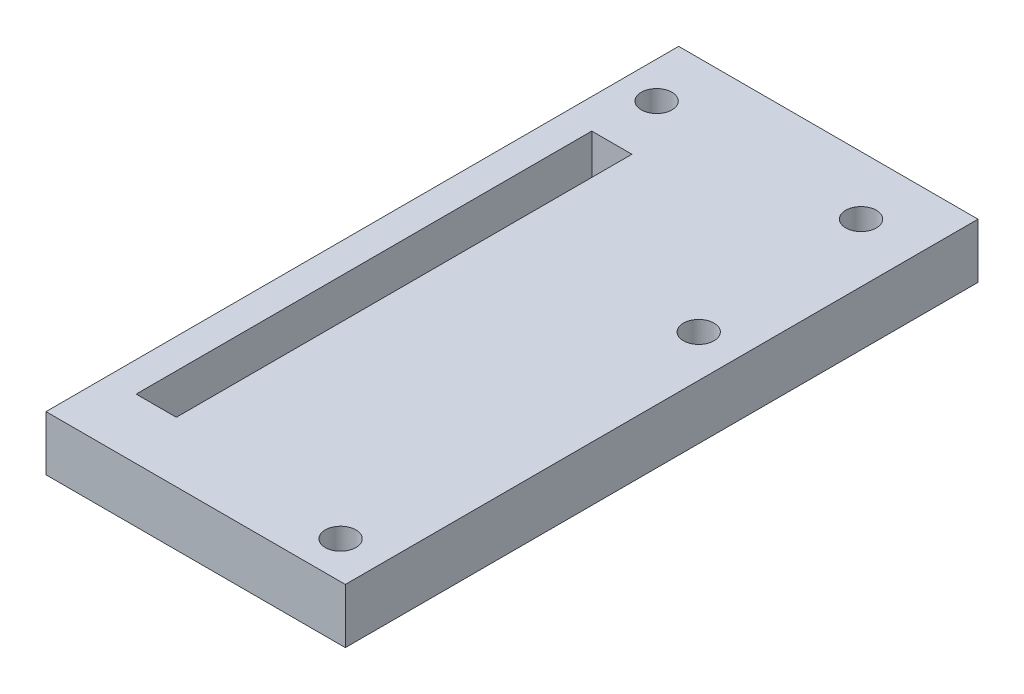
ISO-10303-21;
HEADER;
FILE_DESCRIPTION(('STEP AP214'),'2;1');
FILE_NAME('part.step','',(''),(''),'','','');
FILE_SCHEMA(('AUTOMOTIVE_DESIGN { 1 0 10303 214 1 1 1 1 }'));
ENDSEC;
DATA;
#1=APPLICATION_CONTEXT('core data for automotive mechanical design processes');
#2=APPLICATION_PROTOCOL_DEFINITION('international standard','automotive_design',2000,#1);
#3=PRODUCT_CONTEXT('',#1,'mechanical');
#4=PRODUCT('Part','Part','',(#3));
#5=PRODUCT_RELATED_PRODUCT_CATEGORY('part','',(#4));
#6=PRODUCT_DEFINITION_FORMATION('','',#4);
#7=PRODUCT_DEFINITION_CONTEXT('part definition',#1,'design');
#8=PRODUCT_DEFINITION('design','',#6,#7);
#9=PRODUCT_DEFINITION_SHAPE('','',#8);
#10=(LENGTH_UNIT() NAMED_UNIT(*) SI_UNIT(.MILLI.,.METRE.));
#11=(NAMED_UNIT(*) PLANE_ANGLE_UNIT() SI_UNIT($,.RADIAN.));
#12=(NAMED_UNIT(*) SI_UNIT($,.STERADIAN.) SOLID_ANGLE_UNIT());
#13=UNCERTAINTY_MEASURE_WITH_UNIT(LENGTH_MEASURE(1.E-05),#10,'distance_accuracy_value','');
#14=(GEOMETRIC_REPRESENTATION_CONTEXT(3) GLOBAL_UNCERTAINTY_ASSIGNED_CONTEXT((#13)) GLOBAL_UNIT_ASSIGNED_CONTEXT((#10,
#11,#12)) REPRESENTATION_CONTEXT('',''));
#15=CARTESIAN_POINT('',(0.,0.,0.));
#16=DIRECTION('',(0.,0.,1.));
#17=DIRECTION('',(1.,0.,0.));
#18=AXIS2_PLACEMENT_3D('',#15,#16,#17);
#19=CARTESIAN_POINT('',(0.,7.5,0.));
#20=DIRECTION('',(0.,-1.,0.));
#21=DIRECTION('',(0.,0.,-1.));
#22=AXIS2_PLACEMENT_3D('',#19,#20,#21);
#23=PLANE('',#22);
#24=DIRECTION('',(1.,0.,0.));
#25=VECTOR('',#24,1.);
#26=CARTESIAN_POINT('',(-10.9,7.5,-27.325));
#27=LINE('',#26,#25);
#28=CARTESIAN_POINT('',(-10.9,7.5,-27.325));
#29=VERTEX_POINT('',#28);
#30=CARTESIAN_POINT('',(-5.4,7.5,-27.325));
#31=VERTEX_POINT('',#30);
#32=EDGE_CURVE('E61',#29,#31,#27,.T.);
#33=ORIENTED_EDGE('',*,*,#32,.T.);
#34=DIRECTION('',(0.,0.,1.));
#35=VECTOR('',#34,1.);
#36=CARTESIAN_POINT('',(-5.4,7.5,-27.325));
#37=LINE('',#36,#35);
#38=CARTESIAN_POINT('',(-5.39999999999999,7.5,35.075));
#39=VERTEX_POINT('',#38);
#40=EDGE_CURVE('E140',#31,#39,#37,.T.);
#41=ORIENTED_EDGE('',*,*,#40,.T.);
#42=DIRECTION('',(-1.,0.,0.));
#43=VECTOR('',#42,1.);
#44=CARTESIAN_POINT('',(-5.39999999999999,7.5,35.075));
#45=LINE('',#44,#43);
#46=CARTESIAN_POINT('',(-10.9,7.5,35.075));
#47=VERTEX_POINT('',#46);
#48=EDGE_CURVE('E137',#39,#47,#45,.T.);
#49=ORIENTED_EDGE('',*,*,#48,.T.);
#50=DIRECTION('',(0.,0.,-1.));
#51=VECTOR('',#50,1.);
#52=CARTESIAN_POINT('',(-10.9,7.5,35.075));
#53=LINE('',#52,#51);
#54=EDGE_CURVE('E133',#47,#29,#53,.T.);
#55=ORIENTED_EDGE('',*,*,#54,.T.);
#56=EDGE_LOOP('',(#33,#41,#49,#55));
#57=FACE_BOUND('',#56,.T.);
#58=CARTESIAN_POINT('',(-10.018,7.5,-35.325));
#59=DIRECTION('',(0.,1.,0.));
#60=DIRECTION('',(0.,0.,1.));
#61=AXIS2_PLACEMENT_3D('',#58,#59,#60);
#62=CIRCLE('',#61,2.1);
#63=CARTESIAN_POINT('',(-10.018,7.5,-33.225));
#64=VERTEX_POINT('',#63);
#65=EDGE_CURVE('E152',#64,#64,#62,.T.);
#66=ORIENTED_EDGE('',*,*,#65,.F.);
#67=EDGE_LOOP('',(#66));
#68=FACE_BOUND('',#67,.T.);
#69=CARTESIAN_POINT('',(17.982,7.5,-35.325));
#70=DIRECTION('',(0.,1.,0.));
#71=DIRECTION('',(0.,0.,1.));
#72=AXIS2_PLACEMENT_3D('',#69,#70,#71);
#73=CIRCLE('',#72,2.1);
#74=CARTESIAN_POINT('',(17.982,7.5,-33.225));
#75=VERTEX_POINT('',#74);
#76=EDGE_CURVE('E159',#75,#75,#73,.T.);
#77=ORIENTED_EDGE('',*,*,#76,.F.);
#78=EDGE_LOOP('',(#77));
#79=FACE_BOUND('',#78,.T.);
#80=CARTESIAN_POINT('',(20.25,7.5,38.229));
#81=DIRECTION('',(0.,1.,0.));
#82=DIRECTION('',(0.,0.,1.));
#83=AXIS2_PLACEMENT_3D('',#80,#81,#82);
#84=CIRCLE('',#83,2.1);
#85=CARTESIAN_POINT('',(20.25,7.5,40.329));
#86=VERTEX_POINT('',#85);
#87=EDGE_CURVE('E164',#86,#86,#84,.T.);
#88=ORIENTED_EDGE('',*,*,#87,.F.);
#89=EDGE_LOOP('',(#88));
#90=FACE_BOUND('',#89,.T.);
#91=CARTESIAN_POINT('',(20.25,7.5,-10.821));
#92=DIRECTION('',(0.,1.,0.));
#93=DIRECTION('',(0.,0.,1.));
#94=AXIS2_PLACEMENT_3D('',#91,#92,#93);
#95=CIRCLE('',#94,2.1);
#96=CARTESIAN_POINT('',(20.25,7.5,-8.721));
#97=VERTEX_POINT('',#96);
#98=EDGE_CURVE('E171',#97,#97,#95,.T.);
#99=ORIENTED_EDGE('',*,*,#98,.F.);
#100=EDGE_LOOP('',(#99));
#101=FACE_BOUND('',#100,.T.);
#102=DIRECTION('',(0.,0.,-1.));
#103=VECTOR('',#102,1.);
#104=CARTESIAN_POINT('',(-15.,7.5,-43.325));
#105=LINE('',#104,#103);
#106=CARTESIAN_POINT('',(-15.,7.5,43.325));
#107=VERTEX_POINT('',#106);
#108=CARTESIAN_POINT('',(-15.,7.5,-43.325));
#109=VERTEX_POINT('',#108);
#110=EDGE_CURVE('E116',#107,#109,#105,.T.);
#111=ORIENTED_EDGE('',*,*,#110,.F.);
#112=DIRECTION('',(1.,0.,0.));
#113=VECTOR('',#112,1.);
#114=CARTESIAN_POINT('',(25.,7.5,43.325));
#115=LINE('',#114,#113);
#116=CARTESIAN_POINT('',(26.,7.5,43.325));
#117=VERTEX_POINT('',#116);
#118=EDGE_CURVE('E45',#107,#117,#115,.T.);
#119=ORIENTED_EDGE('',*,*,#118,.T.);
#120=DIRECTION('',(0.,0.,1.));
#121=VECTOR('',#120,1.);
#122=CARTESIAN_POINT('',(26.,7.5,43.325));
#123=LINE('',#122,#121);
#124=CARTESIAN_POINT('',(26.,7.5,-43.325));
#125=VERTEX_POINT('',#124);
#126=EDGE_CURVE('E168',#125,#117,#123,.T.);
#127=ORIENTED_EDGE('',*,*,#126,.F.);
#128=DIRECTION('',(-1.,0.,0.));
#129=VECTOR('',#128,1.);
#130=CARTESIAN_POINT('',(25.,7.5,-43.325));
#131=LINE('',#130,#129);
#132=EDGE_CURVE('E11',#125,#109,#131,.T.);
#133=ORIENTED_EDGE('',*,*,#132,.T.);
#134=EDGE_LOOP('',(#111,#119,#127,#133));
#135=FACE_BOUND('',#134,.T.);
#136=ADVANCED_FACE('F36',(#57,#68,#79,#90,#101,#135),#23,.F.);
#137=CARTESIAN_POINT('',(25.,7.5,43.325));
#138=DIRECTION('',(0.,0.,-1.));
#139=DIRECTION('',(-1.,0.,0.));
#140=AXIS2_PLACEMENT_3D('',#137,#138,#139);
#141=PLANE('',#140);
#142=DIRECTION('',(0.,1.,0.));
#143=VECTOR('',#142,1.);
#144=CARTESIAN_POINT('',(-15.,7.5,43.325));
#145=LINE('',#144,#143);
#146=CARTESIAN_POINT('',(-15.,0.,43.325));
#147=VERTEX_POINT('',#146);
#148=EDGE_CURVE('E105',#147,#107,#145,.T.);
#149=ORIENTED_EDGE('',*,*,#148,.F.);
#150=DIRECTION('',(1.,0.,0.));
#151=VECTOR('',#150,1.);
#152=CARTESIAN_POINT('',(25.,0.,43.325));
#153=LINE('',#152,#151);
#154=CARTESIAN_POINT('',(26.,0.,43.325));
#155=VERTEX_POINT('',#154);
#156=EDGE_CURVE('E114',#147,#155,#153,.T.);
#157=ORIENTED_EDGE('',*,*,#156,.T.);
#158=DIRECTION('',(0.,-1.,0.));
#159=VECTOR('',#158,1.);
#160=CARTESIAN_POINT('',(26.,7.5,43.325));
#161=LINE('',#160,#159);
#162=EDGE_CURVE('E182',#117,#155,#161,.T.);
#163=ORIENTED_EDGE('',*,*,#162,.F.);
#164=ORIENTED_EDGE('',*,*,#118,.F.);
#165=EDGE_LOOP('',(#149,#157,#163,#164));
#166=FACE_BOUND('',#165,.T.);
#167=ADVANCED_FACE('F38',(#166),#141,.F.);
#168=CARTESIAN_POINT('',(25.,7.5,-43.325));
#169=DIRECTION('',(0.,0.,1.));
#170=DIRECTION('',(1.,0.,0.));
#171=AXIS2_PLACEMENT_3D('',#168,#169,#170);
#172=PLANE('',#171);
#173=DIRECTION('',(0.,-1.,0.));
#174=VECTOR('',#173,1.);
#175=CARTESIAN_POINT('',(-15.,7.5,-43.325));
#176=LINE('',#175,#174);
#177=CARTESIAN_POINT('',(-15.,0.,-43.325));
#178=VERTEX_POINT('',#177);
#179=EDGE_CURVE('E53',#109,#178,#176,.T.);
#180=ORIENTED_EDGE('',*,*,#179,.F.);
#181=ORIENTED_EDGE('',*,*,#132,.F.);
#182=DIRECTION('',(0.,1.,0.));
#183=VECTOR('',#182,1.);
#184=CARTESIAN_POINT('',(26.,7.5,-43.325));
#185=LINE('',#184,#183);
#186=CARTESIAN_POINT('',(26.,0.,-43.325));
#187=VERTEX_POINT('',#186);
#188=EDGE_CURVE('E178',#187,#125,#185,.T.);
#189=ORIENTED_EDGE('',*,*,#188,.F.);
#190=DIRECTION('',(-1.,0.,0.));
#191=VECTOR('',#190,1.);
#192=CARTESIAN_POINT('',(25.,0.,-43.325));
#193=LINE('',#192,#191);
#194=EDGE_CURVE('E40',#187,#178,#193,.T.);
#195=ORIENTED_EDGE('',*,*,#194,.T.);
#196=EDGE_LOOP('',(#180,#181,#189,#195));
#197=FACE_BOUND('',#196,.T.);
#198=ADVANCED_FACE('F187',(#197),#172,.F.);
#199=CARTESIAN_POINT('',(0.,0.,0.));
#200=DIRECTION('',(0.,-1.,0.));
#201=DIRECTION('',(0.,0.,-1.));
#202=AXIS2_PLACEMENT_3D('',#199,#200,#201);
#203=PLANE('',#202);
#204=CARTESIAN_POINT('',(20.25,0.,-10.821));
#205=DIRECTION('',(0.,1.,0.));
#206=DIRECTION('',(0.,0.,1.));
#207=AXIS2_PLACEMENT_3D('',#204,#205,#206);
#208=CIRCLE('',#207,2.1);
#209=CARTESIAN_POINT('',(20.25,0.,-8.721));
#210=VERTEX_POINT('',#209);
#211=EDGE_CURVE('E156',#210,#210,#208,.T.);
#212=ORIENTED_EDGE('',*,*,#211,.T.);
#213=EDGE_LOOP('',(#212));
#214=FACE_BOUND('',#213,.T.);
#215=CARTESIAN_POINT('',(20.25,0.,38.229));
#216=DIRECTION('',(0.,1.,0.));
#217=DIRECTION('',(0.,0.,1.));
#218=AXIS2_PLACEMENT_3D('',#215,#216,#217);
#219=CIRCLE('',#218,2.1);
#220=CARTESIAN_POINT('',(20.25,0.,40.329));
#221=VERTEX_POINT('',#220);
#222=EDGE_CURVE('E167',#221,#221,#219,.T.);
#223=ORIENTED_EDGE('',*,*,#222,.T.);
#224=EDGE_LOOP('',(#223));
#225=FACE_BOUND('',#224,.T.);
#226=CARTESIAN_POINT('',(17.982,0.,-35.325));
#227=DIRECTION('',(0.,1.,0.));
#228=DIRECTION('',(0.,0.,1.));
#229=AXIS2_PLACEMENT_3D('',#226,#227,#228);
#230=CIRCLE('',#229,2.1);
#231=CARTESIAN_POINT('',(17.982,0.,-33.225));
#232=VERTEX_POINT('',#231);
#233=EDGE_CURVE('E144',#232,#232,#230,.T.);
#234=ORIENTED_EDGE('',*,*,#233,.T.);
#235=EDGE_LOOP('',(#234));
#236=FACE_BOUND('',#235,.T.);
#237=CARTESIAN_POINT('',(-10.018,0.,-35.325));
#238=DIRECTION('',(0.,1.,0.));
#239=DIRECTION('',(0.,0.,1.));
#240=AXIS2_PLACEMENT_3D('',#237,#238,#239);
#241=CIRCLE('',#240,2.1);
#242=CARTESIAN_POINT('',(-10.018,0.,-33.225));
#243=VERTEX_POINT('',#242);
#244=EDGE_CURVE('E155',#243,#243,#241,.T.);
#245=ORIENTED_EDGE('',*,*,#244,.T.);
#246=EDGE_LOOP('',(#245));
#247=FACE_BOUND('',#246,.T.);
#248=ORIENTED_EDGE('',*,*,#156,.F.);
#249=DIRECTION('',(0.,0.,1.));
#250=VECTOR('',#249,1.);
#251=CARTESIAN_POINT('',(-15.,0.,-43.325));
#252=LINE('',#251,#250);
#253=EDGE_CURVE('E102',#178,#147,#252,.T.);
#254=ORIENTED_EDGE('',*,*,#253,.F.);
#255=ORIENTED_EDGE('',*,*,#194,.F.);
#256=DIRECTION('',(0.,0.,-1.));
#257=VECTOR('',#256,1.);
#258=CARTESIAN_POINT('',(26.,0.,43.325));
#259=LINE('',#258,#257);
#260=EDGE_CURVE('E120',#155,#187,#259,.T.);
#261=ORIENTED_EDGE('',*,*,#260,.F.);
#262=EDGE_LOOP('',(#248,#254,#255,#261));
#263=FACE_BOUND('',#262,.T.);
#264=ADVANCED_FACE('F118',(#214,#225,#236,#247,#263),#203,.T.);
#265=CARTESIAN_POINT('',(-10.9,1.55,-27.325));
#266=DIRECTION('',(0.,0.,1.));
#267=DIRECTION('',(1.,0.,0.));
#268=AXIS2_PLACEMENT_3D('',#265,#266,#267);
#269=PLANE('',#268);
#270=ORIENTED_EDGE('',*,*,#32,.F.);
#271=DIRECTION('',(0.,1.,0.));
#272=VECTOR('',#271,1.);
#273=CARTESIAN_POINT('',(-10.9,1.55,-27.325));
#274=LINE('',#273,#272);
#275=CARTESIAN_POINT('',(-10.9,1.55,-27.325));
#276=VERTEX_POINT('',#275);
#277=EDGE_CURVE('E130',#276,#29,#274,.T.);
#278=ORIENTED_EDGE('',*,*,#277,.F.);
#279=DIRECTION('',(1.,0.,0.));
#280=VECTOR('',#279,1.);
#281=CARTESIAN_POINT('',(-10.9,1.55,-27.325));
#282=LINE('',#281,#280);
#283=CARTESIAN_POINT('',(-5.4,1.55,-27.325));
#284=VERTEX_POINT('',#283);
#285=EDGE_CURVE('E136',#276,#284,#282,.T.);
#286=ORIENTED_EDGE('',*,*,#285,.T.);
#287=DIRECTION('',(0.,1.,0.));
#288=VECTOR('',#287,1.);
#289=CARTESIAN_POINT('',(-5.4,1.55,-27.325));
#290=LINE('',#289,#288);
#291=EDGE_CURVE('E122',#284,#31,#290,.T.);
#292=ORIENTED_EDGE('',*,*,#291,.T.);
#293=EDGE_LOOP('',(#270,#278,#286,#292));
#294=FACE_BOUND('',#293,.T.);
#295=ADVANCED_FACE('F212',(#294),#269,.T.);
#296=CARTESIAN_POINT('',(-5.4,1.55,-27.325));
#297=DIRECTION('',(-1.,0.,0.));
#298=DIRECTION('',(0.,0.,1.));
#299=AXIS2_PLACEMENT_3D('',#296,#297,#298);
#300=PLANE('',#299);
#301=ORIENTED_EDGE('',*,*,#40,.F.);
#302=ORIENTED_EDGE('',*,*,#291,.F.);
#303=DIRECTION('',(0.,0.,1.));
#304=VECTOR('',#303,1.);
#305=CARTESIAN_POINT('',(-5.4,1.55,-27.325));
#306=LINE('',#305,#304);
#307=CARTESIAN_POINT('',(-5.39999999999999,1.55,35.075));
#308=VERTEX_POINT('',#307);
#309=EDGE_CURVE('E148',#284,#308,#306,.T.);
#310=ORIENTED_EDGE('',*,*,#309,.T.);
#311=DIRECTION('',(0.,1.,0.));
#312=VECTOR('',#311,1.);
#313=CARTESIAN_POINT('',(-5.39999999999999,1.55,35.075));
#314=LINE('',#313,#312);
#315=EDGE_CURVE('E123',#308,#39,#314,.T.);
#316=ORIENTED_EDGE('',*,*,#315,.T.);
#317=EDGE_LOOP('',(#301,#302,#310,#316));
#318=FACE_BOUND('',#317,.T.);
#319=ADVANCED_FACE('F232',(#318),#300,.T.);
#320=CARTESIAN_POINT('',(-5.39999999999999,1.55,35.075));
#321=DIRECTION('',(0.,0.,-1.));
#322=DIRECTION('',(-1.,0.,0.));
#323=AXIS2_PLACEMENT_3D('',#320,#321,#322);
#324=PLANE('',#323);
#325=ORIENTED_EDGE('',*,*,#48,.F.);
#326=ORIENTED_EDGE('',*,*,#315,.F.);
#327=DIRECTION('',(-1.,0.,0.));
#328=VECTOR('',#327,1.);
#329=CARTESIAN_POINT('',(-5.39999999999999,1.55,35.075));
#330=LINE('',#329,#328);
#331=CARTESIAN_POINT('',(-10.9,1.55,35.075));
#332=VERTEX_POINT('',#331);
#333=EDGE_CURVE('E146',#308,#332,#330,.T.);
#334=ORIENTED_EDGE('',*,*,#333,.T.);
#335=DIRECTION('',(0.,1.,0.));
#336=VECTOR('',#335,1.);
#337=CARTESIAN_POINT('',(-10.9,1.55,35.075));
#338=LINE('',#337,#336);
#339=EDGE_CURVE('E128',#332,#47,#338,.T.);
#340=ORIENTED_EDGE('',*,*,#339,.T.);
#341=EDGE_LOOP('',(#325,#326,#334,#340));
#342=FACE_BOUND('',#341,.T.);
#343=ADVANCED_FACE('F238',(#342),#324,.T.);
#344=CARTESIAN_POINT('',(-10.9,1.55,35.075));
#345=DIRECTION('',(1.,0.,0.));
#346=DIRECTION('',(0.,0.,-1.));
#347=AXIS2_PLACEMENT_3D('',#344,#345,#346);
#348=PLANE('',#347);
#349=ORIENTED_EDGE('',*,*,#54,.F.);
#350=ORIENTED_EDGE('',*,*,#339,.F.);
#351=DIRECTION('',(0.,0.,-1.));
#352=VECTOR('',#351,1.);
#353=CARTESIAN_POINT('',(-10.9,1.55,35.075));
#354=LINE('',#353,#352);
#355=EDGE_CURVE('E132',#332,#276,#354,.T.);
#356=ORIENTED_EDGE('',*,*,#355,.T.);
#357=ORIENTED_EDGE('',*,*,#277,.T.);
#358=EDGE_LOOP('',(#349,#350,#356,#357));
#359=FACE_BOUND('',#358,.T.);
#360=ADVANCED_FACE('F245',(#359),#348,.T.);
#361=CARTESIAN_POINT('',(0.,1.55,0.));
#362=DIRECTION('',(0.,-1.,0.));
#363=DIRECTION('',(0.,0.,-1.));
#364=AXIS2_PLACEMENT_3D('',#361,#362,#363);
#365=PLANE('',#364);
#366=ORIENTED_EDGE('',*,*,#285,.F.);
#367=ORIENTED_EDGE('',*,*,#355,.F.);
#368=ORIENTED_EDGE('',*,*,#333,.F.);
#369=ORIENTED_EDGE('',*,*,#309,.F.);
#370=EDGE_LOOP('',(#366,#367,#368,#369));
#371=FACE_BOUND('',#370,.T.);
#372=ADVANCED_FACE('F253',(#371),#365,.F.);
#373=CARTESIAN_POINT('',(-10.018,0.,-35.325));
#374=DIRECTION('',(0.,1.,0.));
#375=DIRECTION('',(0.,0.,1.));
#376=AXIS2_PLACEMENT_3D('',#373,#374,#375);
#377=CYLINDRICAL_SURFACE('',#376,2.1);
#378=ORIENTED_EDGE('',*,*,#244,.F.);
#379=EDGE_LOOP('',(#378));
#380=FACE_BOUND('',#379,.T.);
#381=ORIENTED_EDGE('',*,*,#65,.T.);
#382=EDGE_LOOP('',(#381));
#383=FACE_BOUND('',#382,.T.);
#384=ADVANCED_FACE('F261',(#380,#383),#377,.F.);
#385=CARTESIAN_POINT('',(17.982,0.,-35.325));
#386=DIRECTION('',(0.,1.,0.));
#387=DIRECTION('',(0.,0.,1.));
#388=AXIS2_PLACEMENT_3D('',#385,#386,#387);
#389=CYLINDRICAL_SURFACE('',#388,2.1);
#390=ORIENTED_EDGE('',*,*,#233,.F.);
#391=EDGE_LOOP('',(#390));
#392=FACE_BOUND('',#391,.T.);
#393=ORIENTED_EDGE('',*,*,#76,.T.);
#394=EDGE_LOOP('',(#393));
#395=FACE_BOUND('',#394,.T.);
#396=ADVANCED_FACE('F269',(#392,#395),#389,.F.);
#397=CARTESIAN_POINT('',(20.25,0.,38.229));
#398=DIRECTION('',(0.,1.,0.));
#399=DIRECTION('',(0.,0.,1.));
#400=AXIS2_PLACEMENT_3D('',#397,#398,#399);
#401=CYLINDRICAL_SURFACE('',#400,2.1);
#402=ORIENTED_EDGE('',*,*,#222,.F.);
#403=EDGE_LOOP('',(#402));
#404=FACE_BOUND('',#403,.T.);
#405=ORIENTED_EDGE('',*,*,#87,.T.);
#406=EDGE_LOOP('',(#405));
#407=FACE_BOUND('',#406,.T.);
#408=ADVANCED_FACE('F200',(#404,#407),#401,.F.);
#409=CARTESIAN_POINT('',(20.25,0.,-10.821));
#410=DIRECTION('',(0.,1.,0.));
#411=DIRECTION('',(0.,0.,1.));
#412=AXIS2_PLACEMENT_3D('',#409,#410,#411);
#413=CYLINDRICAL_SURFACE('',#412,2.1);
#414=ORIENTED_EDGE('',*,*,#211,.F.);
#415=EDGE_LOOP('',(#414));
#416=FACE_BOUND('',#415,.T.);
#417=ORIENTED_EDGE('',*,*,#98,.T.);
#418=EDGE_LOOP('',(#417));
#419=FACE_BOUND('',#418,.T.);
#420=ADVANCED_FACE('F193',(#416,#419),#413,.F.);
#421=CARTESIAN_POINT('',(26.,0.,0.));
#422=DIRECTION('',(1.,0.,0.));
#423=DIRECTION('',(0.,0.,-1.));
#424=AXIS2_PLACEMENT_3D('',#421,#422,#423);
#425=PLANE('',#424);
#426=ORIENTED_EDGE('',*,*,#162,.T.);
#427=ORIENTED_EDGE('',*,*,#260,.T.);
#428=ORIENTED_EDGE('',*,*,#188,.T.);
#429=ORIENTED_EDGE('',*,*,#126,.T.);
#430=EDGE_LOOP('',(#426,#427,#428,#429));
#431=FACE_BOUND('',#430,.T.);
#432=ADVANCED_FACE('F191',(#431),#425,.T.);
#433=CARTESIAN_POINT('',(-15.,0.,0.));
#434=DIRECTION('',(-1.,0.,0.));
#435=DIRECTION('',(0.,0.,1.));
#436=AXIS2_PLACEMENT_3D('',#433,#434,#435);
#437=PLANE('',#436);
#438=ORIENTED_EDGE('',*,*,#179,.T.);
#439=ORIENTED_EDGE('',*,*,#253,.T.);
#440=ORIENTED_EDGE('',*,*,#148,.T.);
#441=ORIENTED_EDGE('',*,*,#110,.T.);
#442=EDGE_LOOP('',(#438,#439,#440,#441));
#443=FACE_BOUND('',#442,.T.);
#444=ADVANCED_FACE('F104',(#443),#437,.T.);
#445=CLOSED_SHELL('',(#136,#167,#198,#264,#295,#319,#343,#360,#372,#384,#396,#408,#420,#432,#444));
#446=MANIFOLD_SOLID_BREP('B2',#445);
#447=ADVANCED_BREP_SHAPE_REPRESENTATION('',(#18,#446),#14);
#448=SHAPE_DEFINITION_REPRESENTATION(#9,#447);
ENDSEC;
END-ISO-10303-21;
